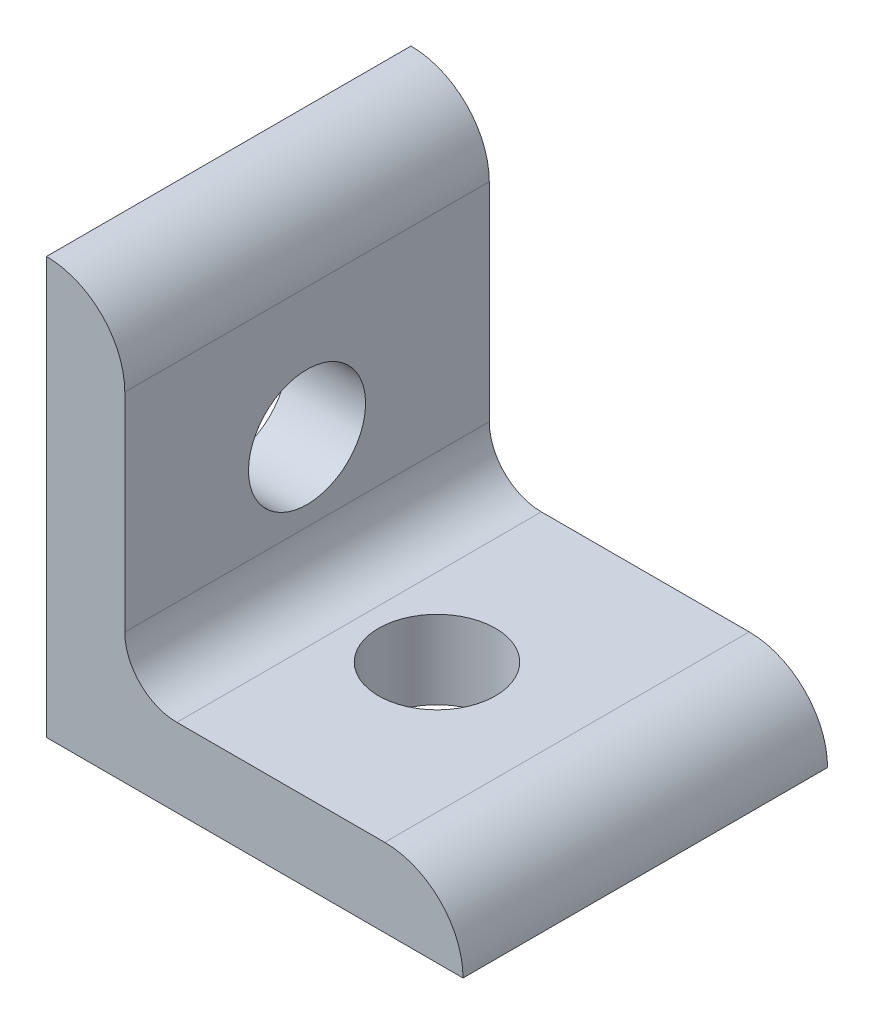
ISO-10303-21;
HEADER;
FILE_DESCRIPTION(('STEP AP214'),'2;1');
FILE_NAME('part.step','',(''),(''),'','','');
FILE_SCHEMA(('AUTOMOTIVE_DESIGN { 1 0 10303 214 1 1 1 1 }'));
ENDSEC;
DATA;
#1=APPLICATION_CONTEXT('core data for automotive mechanical design processes');
#2=APPLICATION_PROTOCOL_DEFINITION('international standard','automotive_design',2000,#1);
#3=PRODUCT_CONTEXT('',#1,'mechanical');
#4=PRODUCT('Part','Part','',(#3));
#5=PRODUCT_RELATED_PRODUCT_CATEGORY('part','',(#4));
#6=PRODUCT_DEFINITION_FORMATION('','',#4);
#7=PRODUCT_DEFINITION_CONTEXT('part definition',#1,'design');
#8=PRODUCT_DEFINITION('design','',#6,#7);
#9=PRODUCT_DEFINITION_SHAPE('','',#8);
#10=(LENGTH_UNIT() NAMED_UNIT(*) SI_UNIT(.MILLI.,.METRE.));
#11=(NAMED_UNIT(*) PLANE_ANGLE_UNIT() SI_UNIT($,.RADIAN.));
#12=(NAMED_UNIT(*) SI_UNIT($,.STERADIAN.) SOLID_ANGLE_UNIT());
#13=UNCERTAINTY_MEASURE_WITH_UNIT(LENGTH_MEASURE(1.E-05),#10,'distance_accuracy_value','');
#14=(GEOMETRIC_REPRESENTATION_CONTEXT(3) GLOBAL_UNCERTAINTY_ASSIGNED_CONTEXT((#13)) GLOBAL_UNIT_ASSIGNED_CONTEXT((#10,
#11,#12)) REPRESENTATION_CONTEXT('',''));
#15=CARTESIAN_POINT('',(0.,0.,0.));
#16=DIRECTION('',(0.,0.,1.));
#17=DIRECTION('',(1.,0.,0.));
#18=AXIS2_PLACEMENT_3D('',#15,#16,#17);
#19=CARTESIAN_POINT('',(12.7,25.4,0.));
#20=DIRECTION('',(0.,-1.,0.));
#21=DIRECTION('',(0.,0.,-1.));
#22=AXIS2_PLACEMENT_3D('',#19,#20,#21);
#23=CYLINDRICAL_SURFACE('',#22,3.5687);
#24=CARTESIAN_POINT('',(12.7,0.,0.));
#25=DIRECTION('',(0.,-1.,0.));
#26=DIRECTION('',(0.,0.,-1.));
#27=AXIS2_PLACEMENT_3D('',#24,#25,#26);
#28=CIRCLE('',#27,3.5687);
#29=CARTESIAN_POINT('',(12.7,0.,-3.5687));
#30=VERTEX_POINT('',#29);
#31=EDGE_CURVE('E108',#30,#30,#28,.T.);
#32=ORIENTED_EDGE('',*,*,#31,.T.);
#33=EDGE_LOOP('',(#32));
#34=FACE_BOUND('',#33,.T.);
#35=CARTESIAN_POINT('',(12.7,4.7752,0.));
#36=DIRECTION('',(0.,-1.,0.));
#37=DIRECTION('',(0.,0.,-1.));
#38=AXIS2_PLACEMENT_3D('',#35,#36,#37);
#39=CIRCLE('',#38,3.5687);
#40=CARTESIAN_POINT('',(12.7,4.7752,-3.5687));
#41=VERTEX_POINT('',#40);
#42=EDGE_CURVE('E21',#41,#41,#39,.F.);
#43=ORIENTED_EDGE('',*,*,#42,.T.);
#44=EDGE_LOOP('',(#43));
#45=FACE_BOUND('',#44,.T.);
#46=ADVANCED_FACE('F18',(#34,#45),#23,.F.);
#47=CARTESIAN_POINT('',(20.6248,0.,11.1125));
#48=DIRECTION('',(0.,0.,-1.));
#49=DIRECTION('',(-1.,0.,0.));
#50=AXIS2_PLACEMENT_3D('',#47,#48,#49);
#51=CYLINDRICAL_SURFACE('',#50,4.7752);
#52=CARTESIAN_POINT('',(20.6248,0.,11.1125));
#53=DIRECTION('',(0.,0.,-1.));
#54=DIRECTION('',(-1.,0.,0.));
#55=AXIS2_PLACEMENT_3D('',#52,#53,#54);
#56=CIRCLE('',#55,4.7752);
#57=CARTESIAN_POINT('',(25.4,0.,11.1125));
#58=VERTEX_POINT('',#57);
#59=CARTESIAN_POINT('',(20.6248,4.7752,11.1125));
#60=VERTEX_POINT('',#59);
#61=EDGE_CURVE('E90',#58,#60,#56,.F.);
#62=ORIENTED_EDGE('',*,*,#61,.F.);
#63=DIRECTION('',(0.,0.,1.));
#64=VECTOR('',#63,1.);
#65=CARTESIAN_POINT('',(25.4,0.,11.1125));
#66=LINE('',#65,#64);
#67=CARTESIAN_POINT('',(25.4,0.,-11.1125));
#68=VERTEX_POINT('',#67);
#69=EDGE_CURVE('E94',#58,#68,#66,.F.);
#70=ORIENTED_EDGE('',*,*,#69,.T.);
#71=CARTESIAN_POINT('',(20.6248,0.,-11.1125));
#72=DIRECTION('',(0.,0.,-1.));
#73=DIRECTION('',(-1.,0.,0.));
#74=AXIS2_PLACEMENT_3D('',#71,#72,#73);
#75=CIRCLE('',#74,4.7752);
#76=CARTESIAN_POINT('',(20.6248,4.7752,-11.1125));
#77=VERTEX_POINT('',#76);
#78=EDGE_CURVE('E166',#68,#77,#75,.F.);
#79=ORIENTED_EDGE('',*,*,#78,.T.);
#80=DIRECTION('',(0.,0.,1.));
#81=VECTOR('',#80,1.);
#82=CARTESIAN_POINT('',(20.6248,4.7752,11.1125));
#83=LINE('',#82,#81);
#84=EDGE_CURVE('E95',#77,#60,#83,.T.);
#85=ORIENTED_EDGE('',*,*,#84,.T.);
#86=EDGE_LOOP('',(#62,#70,#79,#85));
#87=FACE_BOUND('',#86,.T.);
#88=ADVANCED_FACE('F92',(#87),#51,.T.);
#89=CARTESIAN_POINT('',(7.9502,4.7752,11.1125));
#90=DIRECTION('',(0.,-1.,0.));
#91=DIRECTION('',(1.,0.,0.));
#92=AXIS2_PLACEMENT_3D('',#89,#90,#91);
#93=PLANE('',#92);
#94=ORIENTED_EDGE('',*,*,#42,.F.);
#95=EDGE_LOOP('',(#94));
#96=FACE_BOUND('',#95,.T.);
#97=DIRECTION('',(0.,0.,-1.));
#98=VECTOR('',#97,1.);
#99=CARTESIAN_POINT('',(7.9502,4.7752,11.1125));
#100=LINE('',#99,#98);
#101=CARTESIAN_POINT('',(7.9502,4.7752,-11.1125));
#102=VERTEX_POINT('',#101);
#103=CARTESIAN_POINT('',(7.9502,4.7752,11.1125));
#104=VERTEX_POINT('',#103);
#105=EDGE_CURVE('E146',#102,#104,#100,.F.);
#106=ORIENTED_EDGE('',*,*,#105,.T.);
#107=DIRECTION('',(1.,0.,0.));
#108=VECTOR('',#107,1.);
#109=CARTESIAN_POINT('',(0.,4.7752,11.1125));
#110=LINE('',#109,#108);
#111=EDGE_CURVE('E100',#60,#104,#110,.F.);
#112=ORIENTED_EDGE('',*,*,#111,.F.);
#113=ORIENTED_EDGE('',*,*,#84,.F.);
#114=DIRECTION('',(1.,0.,0.));
#115=VECTOR('',#114,1.);
#116=CARTESIAN_POINT('',(0.,4.7752,-11.1125));
#117=LINE('',#116,#115);
#118=EDGE_CURVE('E165',#77,#102,#117,.F.);
#119=ORIENTED_EDGE('',*,*,#118,.T.);
#120=EDGE_LOOP('',(#106,#112,#113,#119));
#121=FACE_BOUND('',#120,.T.);
#122=ADVANCED_FACE('F239',(#96,#121),#93,.F.);
#123=CARTESIAN_POINT('',(7.9502,7.9502,11.1125));
#124=DIRECTION('',(0.,0.,-1.));
#125=DIRECTION('',(-1.,0.,0.));
#126=AXIS2_PLACEMENT_3D('',#123,#124,#125);
#127=CYLINDRICAL_SURFACE('',#126,3.175);
#128=DIRECTION('',(0.,0.,1.));
#129=VECTOR('',#128,1.);
#130=CARTESIAN_POINT('',(4.7752,7.9502,11.1125));
#131=LINE('',#130,#129);
#132=CARTESIAN_POINT('',(4.7752,7.9502,-11.1125));
#133=VERTEX_POINT('',#132);
#134=CARTESIAN_POINT('',(4.7752,7.9502,11.1125));
#135=VERTEX_POINT('',#134);
#136=EDGE_CURVE('E142',#133,#135,#131,.T.);
#137=ORIENTED_EDGE('',*,*,#136,.T.);
#138=CARTESIAN_POINT('',(7.9502,7.9502,11.1125));
#139=DIRECTION('',(0.,0.,-1.));
#140=DIRECTION('',(-1.,0.,0.));
#141=AXIS2_PLACEMENT_3D('',#138,#139,#140);
#142=CIRCLE('',#141,3.175);
#143=EDGE_CURVE('E138',#104,#135,#142,.T.);
#144=ORIENTED_EDGE('',*,*,#143,.F.);
#145=ORIENTED_EDGE('',*,*,#105,.F.);
#146=CARTESIAN_POINT('',(7.9502,7.9502,-11.1125));
#147=DIRECTION('',(0.,0.,-1.));
#148=DIRECTION('',(-1.,0.,0.));
#149=AXIS2_PLACEMENT_3D('',#146,#147,#148);
#150=CIRCLE('',#149,3.175);
#151=EDGE_CURVE('E161',#102,#133,#150,.T.);
#152=ORIENTED_EDGE('',*,*,#151,.T.);
#153=EDGE_LOOP('',(#137,#144,#145,#152));
#154=FACE_BOUND('',#153,.T.);
#155=ADVANCED_FACE('F178',(#154),#127,.F.);
#156=CARTESIAN_POINT('',(4.7752,20.6248,11.1125));
#157=DIRECTION('',(-1.,0.,0.));
#158=DIRECTION('',(0.,-1.,0.));
#159=AXIS2_PLACEMENT_3D('',#156,#157,#158);
#160=PLANE('',#159);
#161=CARTESIAN_POINT('',(4.7752,12.7,0.));
#162=DIRECTION('',(-1.,0.,0.));
#163=DIRECTION('',(0.,0.,1.));
#164=AXIS2_PLACEMENT_3D('',#161,#162,#163);
#165=CIRCLE('',#164,3.5687);
#166=CARTESIAN_POINT('',(4.7752,12.7,3.5687));
#167=VERTEX_POINT('',#166);
#168=EDGE_CURVE('E152',#167,#167,#165,.T.);
#169=ORIENTED_EDGE('',*,*,#168,.T.);
#170=EDGE_LOOP('',(#169));
#171=FACE_BOUND('',#170,.T.);
#172=DIRECTION('',(0.,0.,-1.));
#173=VECTOR('',#172,1.);
#174=CARTESIAN_POINT('',(4.7752,20.6248,11.1125));
#175=LINE('',#174,#173);
#176=CARTESIAN_POINT('',(4.7752,20.6248,11.1125));
#177=VERTEX_POINT('',#176);
#178=CARTESIAN_POINT('',(4.7752,20.6248,-11.1125));
#179=VERTEX_POINT('',#178);
#180=EDGE_CURVE('E101',#177,#179,#175,.T.);
#181=ORIENTED_EDGE('',*,*,#180,.F.);
#182=DIRECTION('',(0.,1.,0.));
#183=VECTOR('',#182,1.);
#184=CARTESIAN_POINT('',(4.7752,20.6248,11.1125));
#185=LINE('',#184,#183);
#186=EDGE_CURVE('E122',#135,#177,#185,.T.);
#187=ORIENTED_EDGE('',*,*,#186,.F.);
#188=ORIENTED_EDGE('',*,*,#136,.F.);
#189=DIRECTION('',(0.,1.,0.));
#190=VECTOR('',#189,1.);
#191=CARTESIAN_POINT('',(4.7752,20.6248,-11.1125));
#192=LINE('',#191,#190);
#193=EDGE_CURVE('E160',#133,#179,#192,.T.);
#194=ORIENTED_EDGE('',*,*,#193,.T.);
#195=EDGE_LOOP('',(#181,#187,#188,#194));
#196=FACE_BOUND('',#195,.T.);
#197=ADVANCED_FACE('F183',(#171,#196),#160,.F.);
#198=CARTESIAN_POINT('',(0.,20.6248,11.1125));
#199=DIRECTION('',(0.,0.,-1.));
#200=DIRECTION('',(-1.,0.,0.));
#201=AXIS2_PLACEMENT_3D('',#198,#199,#200);
#202=CYLINDRICAL_SURFACE('',#201,4.77520000000001);
#203=CARTESIAN_POINT('',(0.,20.6248,11.1125));
#204=DIRECTION('',(0.,0.,-1.));
#205=DIRECTION('',(-1.,0.,0.));
#206=AXIS2_PLACEMENT_3D('',#203,#204,#205);
#207=CIRCLE('',#206,4.77520000000001);
#208=CARTESIAN_POINT('',(0.,25.4,11.1125));
#209=VERTEX_POINT('',#208);
#210=EDGE_CURVE('E115',#177,#209,#207,.F.);
#211=ORIENTED_EDGE('',*,*,#210,.F.);
#212=ORIENTED_EDGE('',*,*,#180,.T.);
#213=CARTESIAN_POINT('',(0.,20.6248,-11.1125));
#214=DIRECTION('',(0.,0.,-1.));
#215=DIRECTION('',(-1.,0.,0.));
#216=AXIS2_PLACEMENT_3D('',#213,#214,#215);
#217=CIRCLE('',#216,4.77520000000001);
#218=CARTESIAN_POINT('',(0.,25.4,-11.1125));
#219=VERTEX_POINT('',#218);
#220=EDGE_CURVE('E156',#179,#219,#217,.F.);
#221=ORIENTED_EDGE('',*,*,#220,.T.);
#222=DIRECTION('',(0.,0.,-1.));
#223=VECTOR('',#222,1.);
#224=CARTESIAN_POINT('',(0.,25.4,11.1125));
#225=LINE('',#224,#223);
#226=EDGE_CURVE('E133',#219,#209,#225,.F.);
#227=ORIENTED_EDGE('',*,*,#226,.T.);
#228=EDGE_LOOP('',(#211,#212,#221,#227));
#229=FACE_BOUND('',#228,.T.);
#230=ADVANCED_FACE('F188',(#229),#202,.T.);
#231=CARTESIAN_POINT('',(0.,20.6248,11.1125));
#232=DIRECTION('',(0.,0.,1.));
#233=DIRECTION('',(1.,0.,0.));
#234=AXIS2_PLACEMENT_3D('',#231,#232,#233);
#235=PLANE('',#234);
#236=ORIENTED_EDGE('',*,*,#210,.T.);
#237=DIRECTION('',(0.,1.,0.));
#238=VECTOR('',#237,1.);
#239=CARTESIAN_POINT('',(0.,0.,11.1125));
#240=LINE('',#239,#238);
#241=CARTESIAN_POINT('',(0.,0.,11.1125));
#242=VERTEX_POINT('',#241);
#243=EDGE_CURVE('E113',#209,#242,#240,.F.);
#244=ORIENTED_EDGE('',*,*,#243,.T.);
#245=DIRECTION('',(-1.,0.,0.));
#246=VECTOR('',#245,1.);
#247=CARTESIAN_POINT('',(25.4,0.,11.1125));
#248=LINE('',#247,#246);
#249=EDGE_CURVE('E105',#242,#58,#248,.F.);
#250=ORIENTED_EDGE('',*,*,#249,.T.);
#251=ORIENTED_EDGE('',*,*,#61,.T.);
#252=ORIENTED_EDGE('',*,*,#111,.T.);
#253=ORIENTED_EDGE('',*,*,#143,.T.);
#254=ORIENTED_EDGE('',*,*,#186,.T.);
#255=EDGE_LOOP('',(#236,#244,#250,#251,#252,#253,#254));
#256=FACE_BOUND('',#255,.T.);
#257=ADVANCED_FACE('F111',(#256),#235,.T.);
#258=CARTESIAN_POINT('',(25.4,0.,11.1125));
#259=DIRECTION('',(0.,1.,0.));
#260=DIRECTION('',(-1.,0.,0.));
#261=AXIS2_PLACEMENT_3D('',#258,#259,#260);
#262=PLANE('',#261);
#263=ORIENTED_EDGE('',*,*,#31,.F.);
#264=EDGE_LOOP('',(#263));
#265=FACE_BOUND('',#264,.T.);
#266=ORIENTED_EDGE('',*,*,#69,.F.);
#267=ORIENTED_EDGE('',*,*,#249,.F.);
#268=DIRECTION('',(0.,0.,-1.));
#269=VECTOR('',#268,1.);
#270=CARTESIAN_POINT('',(0.,0.,11.1125));
#271=LINE('',#270,#269);
#272=CARTESIAN_POINT('',(0.,0.,-11.1125));
#273=VERTEX_POINT('',#272);
#274=EDGE_CURVE('E132',#242,#273,#271,.T.);
#275=ORIENTED_EDGE('',*,*,#274,.T.);
#276=DIRECTION('',(1.,0.,0.));
#277=VECTOR('',#276,1.);
#278=CARTESIAN_POINT('',(0.,0.,-11.1125));
#279=LINE('',#278,#277);
#280=EDGE_CURVE('E41',#273,#68,#279,.T.);
#281=ORIENTED_EDGE('',*,*,#280,.T.);
#282=EDGE_LOOP('',(#266,#267,#275,#281));
#283=FACE_BOUND('',#282,.T.);
#284=ADVANCED_FACE('F103',(#265,#283),#262,.F.);
#285=CARTESIAN_POINT('',(0.,20.6248,-11.1125));
#286=DIRECTION('',(0.,0.,1.));
#287=DIRECTION('',(1.,0.,0.));
#288=AXIS2_PLACEMENT_3D('',#285,#286,#287);
#289=PLANE('',#288);
#290=DIRECTION('',(0.,1.,0.));
#291=VECTOR('',#290,1.);
#292=CARTESIAN_POINT('',(0.,0.,-11.1125));
#293=LINE('',#292,#291);
#294=EDGE_CURVE('E28',#273,#219,#293,.T.);
#295=ORIENTED_EDGE('',*,*,#294,.T.);
#296=ORIENTED_EDGE('',*,*,#220,.F.);
#297=ORIENTED_EDGE('',*,*,#193,.F.);
#298=ORIENTED_EDGE('',*,*,#151,.F.);
#299=ORIENTED_EDGE('',*,*,#118,.F.);
#300=ORIENTED_EDGE('',*,*,#78,.F.);
#301=ORIENTED_EDGE('',*,*,#280,.F.);
#302=EDGE_LOOP('',(#295,#296,#297,#298,#299,#300,#301));
#303=FACE_BOUND('',#302,.T.);
#304=ADVANCED_FACE('F244',(#303),#289,.F.);
#305=CARTESIAN_POINT('',(25.4,12.7,0.));
#306=DIRECTION('',(-1.,0.,0.));
#307=DIRECTION('',(0.,0.,1.));
#308=AXIS2_PLACEMENT_3D('',#305,#306,#307);
#309=CYLINDRICAL_SURFACE('',#308,3.5687);
#310=CARTESIAN_POINT('',(0.,12.7,0.));
#311=DIRECTION('',(-1.,0.,0.));
#312=DIRECTION('',(0.,0.,1.));
#313=AXIS2_PLACEMENT_3D('',#310,#311,#312);
#314=CIRCLE('',#313,3.5687);
#315=CARTESIAN_POINT('',(0.,12.7,3.5687));
#316=VERTEX_POINT('',#315);
#317=EDGE_CURVE('E11',#316,#316,#314,.T.);
#318=ORIENTED_EDGE('',*,*,#317,.T.);
#319=EDGE_LOOP('',(#318));
#320=FACE_BOUND('',#319,.T.);
#321=ORIENTED_EDGE('',*,*,#168,.F.);
#322=EDGE_LOOP('',(#321));
#323=FACE_BOUND('',#322,.T.);
#324=ADVANCED_FACE('F246',(#320,#323),#309,.F.);
#325=CARTESIAN_POINT('',(0.,0.,11.1125));
#326=DIRECTION('',(1.,0.,0.));
#327=DIRECTION('',(0.,0.,-1.));
#328=AXIS2_PLACEMENT_3D('',#325,#326,#327);
#329=PLANE('',#328);
#330=ORIENTED_EDGE('',*,*,#317,.F.);
#331=EDGE_LOOP('',(#330));
#332=FACE_BOUND('',#331,.T.);
#333=ORIENTED_EDGE('',*,*,#274,.F.);
#334=ORIENTED_EDGE('',*,*,#243,.F.);
#335=ORIENTED_EDGE('',*,*,#226,.F.);
#336=ORIENTED_EDGE('',*,*,#294,.F.);
#337=EDGE_LOOP('',(#333,#334,#335,#336));
#338=FACE_BOUND('',#337,.T.);
#339=ADVANCED_FACE('F190',(#332,#338),#329,.F.);
#340=CLOSED_SHELL('',(#46,#88,#122,#155,#197,#230,#257,#284,#304,#324,#339));
#341=MANIFOLD_SOLID_BREP('B1',#340);
#342=ADVANCED_BREP_SHAPE_REPRESENTATION('',(#18,#341),#14);
#343=SHAPE_DEFINITION_REPRESENTATION(#9,#342);
ENDSEC;
END-ISO-10303-21;
